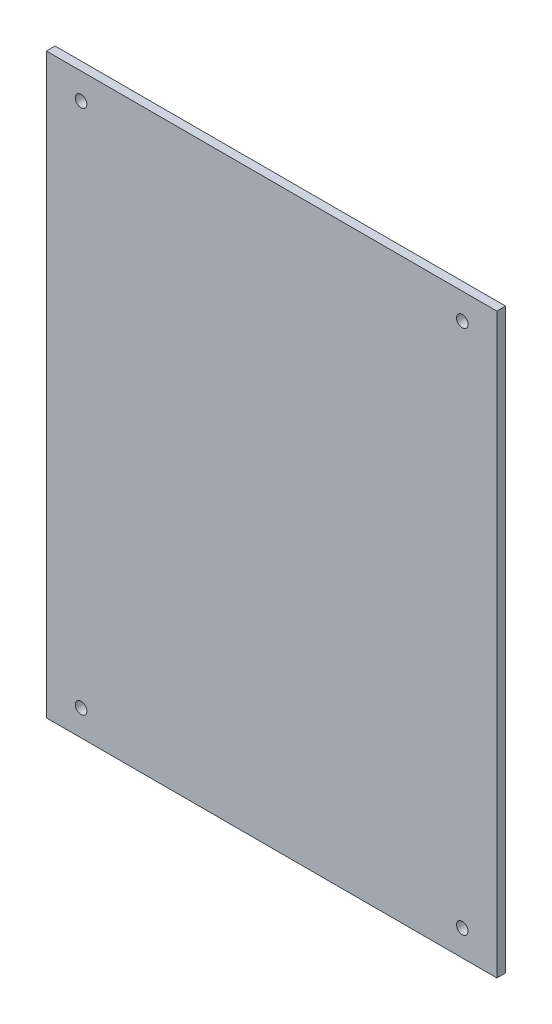
ISO-10303-21;
HEADER;
FILE_DESCRIPTION(('STEP AP214'),'2;1');
FILE_NAME('part.step','',(''),(''),'','','');
FILE_SCHEMA(('AUTOMOTIVE_DESIGN { 1 0 10303 214 1 1 1 1 }'));
ENDSEC;
DATA;
#1=APPLICATION_CONTEXT('core data for automotive mechanical design processes');
#2=APPLICATION_PROTOCOL_DEFINITION('international standard','automotive_design',2000,#1);
#3=PRODUCT_CONTEXT('',#1,'mechanical');
#4=PRODUCT('Part','Part','',(#3));
#5=PRODUCT_RELATED_PRODUCT_CATEGORY('part','',(#4));
#6=PRODUCT_DEFINITION_FORMATION('','',#4);
#7=PRODUCT_DEFINITION_CONTEXT('part definition',#1,'design');
#8=PRODUCT_DEFINITION('design','',#6,#7);
#9=PRODUCT_DEFINITION_SHAPE('','',#8);
#10=(LENGTH_UNIT() NAMED_UNIT(*) SI_UNIT(.MILLI.,.METRE.));
#11=(NAMED_UNIT(*) PLANE_ANGLE_UNIT() SI_UNIT($,.RADIAN.));
#12=(NAMED_UNIT(*) SI_UNIT($,.STERADIAN.) SOLID_ANGLE_UNIT());
#13=UNCERTAINTY_MEASURE_WITH_UNIT(LENGTH_MEASURE(1.E-05),#10,'distance_accuracy_value','');
#14=(GEOMETRIC_REPRESENTATION_CONTEXT(3) GLOBAL_UNCERTAINTY_ASSIGNED_CONTEXT((#13)) GLOBAL_UNIT_ASSIGNED_CONTEXT((#10,
#11,#12)) REPRESENTATION_CONTEXT('',''));
#15=CARTESIAN_POINT('',(0.,0.,0.));
#16=DIRECTION('',(0.,0.,1.));
#17=DIRECTION('',(1.,0.,0.));
#18=AXIS2_PLACEMENT_3D('',#15,#16,#17);
#19=CARTESIAN_POINT('',(0.,0.,3.));
#20=DIRECTION('',(1.,0.,0.));
#21=DIRECTION('',(0.,0.,-1.));
#22=AXIS2_PLACEMENT_3D('',#19,#20,#21);
#23=PLANE('',#22);
#24=DIRECTION('',(0.,-1.,0.));
#25=VECTOR('',#24,1.);
#26=CARTESIAN_POINT('',(0.,0.,0.));
#27=LINE('',#26,#25);
#28=CARTESIAN_POINT('',(0.,200.,0.));
#29=VERTEX_POINT('',#28);
#30=CARTESIAN_POINT('',(0.,0.,0.));
#31=VERTEX_POINT('',#30);
#32=EDGE_CURVE('E96',#29,#31,#27,.T.);
#33=ORIENTED_EDGE('',*,*,#32,.T.);
#34=DIRECTION('',(0.,0.,-1.));
#35=VECTOR('',#34,1.);
#36=CARTESIAN_POINT('',(0.,0.,3.));
#37=LINE('',#36,#35);
#38=CARTESIAN_POINT('',(0.,0.,3.));
#39=VERTEX_POINT('',#38);
#40=EDGE_CURVE('E11',#39,#31,#37,.T.);
#41=ORIENTED_EDGE('',*,*,#40,.F.);
#42=DIRECTION('',(0.,-1.,0.));
#43=VECTOR('',#42,1.);
#44=CARTESIAN_POINT('',(0.,0.,3.));
#45=LINE('',#44,#43);
#46=CARTESIAN_POINT('',(0.,200.,3.));
#47=VERTEX_POINT('',#46);
#48=EDGE_CURVE('E84',#47,#39,#45,.T.);
#49=ORIENTED_EDGE('',*,*,#48,.F.);
#50=DIRECTION('',(0.,0.,-1.));
#51=VECTOR('',#50,1.);
#52=CARTESIAN_POINT('',(0.,200.,3.));
#53=LINE('',#52,#51);
#54=EDGE_CURVE('E92',#47,#29,#53,.T.);
#55=ORIENTED_EDGE('',*,*,#54,.T.);
#56=EDGE_LOOP('',(#33,#41,#49,#55));
#57=FACE_BOUND('',#56,.T.);
#58=ADVANCED_FACE('F33',(#57),#23,.F.);
#59=CARTESIAN_POINT('',(0.,0.,3.));
#60=DIRECTION('',(0.,1.,0.));
#61=DIRECTION('',(0.,0.,1.));
#62=AXIS2_PLACEMENT_3D('',#59,#60,#61);
#63=PLANE('',#62);
#64=DIRECTION('',(1.,0.,0.));
#65=VECTOR('',#64,1.);
#66=CARTESIAN_POINT('',(0.,0.,0.));
#67=LINE('',#66,#65);
#68=CARTESIAN_POINT('',(156.,0.,0.));
#69=VERTEX_POINT('',#68);
#70=EDGE_CURVE('E88',#31,#69,#67,.T.);
#71=ORIENTED_EDGE('',*,*,#70,.T.);
#72=DIRECTION('',(0.,0.,-1.));
#73=VECTOR('',#72,1.);
#74=CARTESIAN_POINT('',(156.,0.,3.));
#75=LINE('',#74,#73);
#76=CARTESIAN_POINT('',(156.,0.,3.));
#77=VERTEX_POINT('',#76);
#78=EDGE_CURVE('E41',#77,#69,#75,.T.);
#79=ORIENTED_EDGE('',*,*,#78,.F.);
#80=DIRECTION('',(1.,0.,0.));
#81=VECTOR('',#80,1.);
#82=CARTESIAN_POINT('',(0.,0.,3.));
#83=LINE('',#82,#81);
#84=EDGE_CURVE('E79',#39,#77,#83,.T.);
#85=ORIENTED_EDGE('',*,*,#84,.F.);
#86=ORIENTED_EDGE('',*,*,#40,.T.);
#87=EDGE_LOOP('',(#71,#79,#85,#86));
#88=FACE_BOUND('',#87,.T.);
#89=ADVANCED_FACE('F87',(#88),#63,.F.);
#90=CARTESIAN_POINT('',(156.,0.,3.));
#91=DIRECTION('',(-1.,0.,0.));
#92=DIRECTION('',(0.,0.,1.));
#93=AXIS2_PLACEMENT_3D('',#90,#91,#92);
#94=PLANE('',#93);
#95=DIRECTION('',(0.,1.,0.));
#96=VECTOR('',#95,1.);
#97=CARTESIAN_POINT('',(156.,0.,0.));
#98=LINE('',#97,#96);
#99=CARTESIAN_POINT('',(156.,200.,0.));
#100=VERTEX_POINT('',#99);
#101=EDGE_CURVE('E66',#69,#100,#98,.T.);
#102=ORIENTED_EDGE('',*,*,#101,.T.);
#103=DIRECTION('',(0.,0.,-1.));
#104=VECTOR('',#103,1.);
#105=CARTESIAN_POINT('',(156.,200.,3.));
#106=LINE('',#105,#104);
#107=CARTESIAN_POINT('',(156.,200.,3.));
#108=VERTEX_POINT('',#107);
#109=EDGE_CURVE('E89',#108,#100,#106,.T.);
#110=ORIENTED_EDGE('',*,*,#109,.F.);
#111=DIRECTION('',(0.,1.,0.));
#112=VECTOR('',#111,1.);
#113=CARTESIAN_POINT('',(156.,0.,3.));
#114=LINE('',#113,#112);
#115=EDGE_CURVE('E82',#77,#108,#114,.T.);
#116=ORIENTED_EDGE('',*,*,#115,.F.);
#117=ORIENTED_EDGE('',*,*,#78,.T.);
#118=EDGE_LOOP('',(#102,#110,#116,#117));
#119=FACE_BOUND('',#118,.T.);
#120=ADVANCED_FACE('F90',(#119),#94,.F.);
#121=CARTESIAN_POINT('',(0.,200.,3.));
#122=DIRECTION('',(0.,-1.,0.));
#123=DIRECTION('',(0.,0.,-1.));
#124=AXIS2_PLACEMENT_3D('',#121,#122,#123);
#125=PLANE('',#124);
#126=DIRECTION('',(-1.,0.,0.));
#127=VECTOR('',#126,1.);
#128=CARTESIAN_POINT('',(0.,200.,0.));
#129=LINE('',#128,#127);
#130=EDGE_CURVE('E72',#100,#29,#129,.T.);
#131=ORIENTED_EDGE('',*,*,#130,.T.);
#132=ORIENTED_EDGE('',*,*,#54,.F.);
#133=DIRECTION('',(-1.,0.,0.));
#134=VECTOR('',#133,1.);
#135=CARTESIAN_POINT('',(0.,200.,3.));
#136=LINE('',#135,#134);
#137=EDGE_CURVE('E49',#108,#47,#136,.T.);
#138=ORIENTED_EDGE('',*,*,#137,.F.);
#139=ORIENTED_EDGE('',*,*,#109,.T.);
#140=EDGE_LOOP('',(#131,#132,#138,#139));
#141=FACE_BOUND('',#140,.T.);
#142=ADVANCED_FACE('F104',(#141),#125,.F.);
#143=CARTESIAN_POINT('',(0.,0.,3.));
#144=DIRECTION('',(0.,0.,-1.));
#145=DIRECTION('',(-1.,0.,0.));
#146=AXIS2_PLACEMENT_3D('',#143,#144,#145);
#147=PLANE('',#146);
#148=CARTESIAN_POINT('',(144.,9.00000000000002,3.));
#149=DIRECTION('',(0.,0.,1.));
#150=DIRECTION('',(-1.,0.,0.));
#151=AXIS2_PLACEMENT_3D('',#148,#149,#150);
#152=CIRCLE('',#151,2.);
#153=CARTESIAN_POINT('',(142.,9.00000000000002,3.));
#154=VERTEX_POINT('',#153);
#155=EDGE_CURVE('E128',#154,#154,#152,.T.);
#156=ORIENTED_EDGE('',*,*,#155,.F.);
#157=EDGE_LOOP('',(#156));
#158=FACE_BOUND('',#157,.T.);
#159=CARTESIAN_POINT('',(144.,191.,3.));
#160=DIRECTION('',(0.,0.,1.));
#161=DIRECTION('',(1.,0.,0.));
#162=AXIS2_PLACEMENT_3D('',#159,#160,#161);
#163=CIRCLE('',#162,2.);
#164=CARTESIAN_POINT('',(146.,191.,3.));
#165=VERTEX_POINT('',#164);
#166=EDGE_CURVE('E122',#165,#165,#163,.T.);
#167=ORIENTED_EDGE('',*,*,#166,.F.);
#168=EDGE_LOOP('',(#167));
#169=FACE_BOUND('',#168,.T.);
#170=CARTESIAN_POINT('',(12.,191.,3.));
#171=DIRECTION('',(0.,0.,1.));
#172=DIRECTION('',(-1.,0.,0.));
#173=AXIS2_PLACEMENT_3D('',#170,#171,#172);
#174=CIRCLE('',#173,2.);
#175=CARTESIAN_POINT('',(9.99999999999998,191.,3.));
#176=VERTEX_POINT('',#175);
#177=EDGE_CURVE('E116',#176,#176,#174,.T.);
#178=ORIENTED_EDGE('',*,*,#177,.F.);
#179=EDGE_LOOP('',(#178));
#180=FACE_BOUND('',#179,.T.);
#181=CARTESIAN_POINT('',(12.,9.00000000000001,3.));
#182=DIRECTION('',(0.,0.,1.));
#183=DIRECTION('',(1.,0.,0.));
#184=AXIS2_PLACEMENT_3D('',#181,#182,#183);
#185=CIRCLE('',#184,2.);
#186=CARTESIAN_POINT('',(14.,9.00000000000001,3.));
#187=VERTEX_POINT('',#186);
#188=EDGE_CURVE('E110',#187,#187,#185,.T.);
#189=ORIENTED_EDGE('',*,*,#188,.F.);
#190=EDGE_LOOP('',(#189));
#191=FACE_BOUND('',#190,.T.);
#192=ORIENTED_EDGE('',*,*,#48,.T.);
#193=ORIENTED_EDGE('',*,*,#84,.T.);
#194=ORIENTED_EDGE('',*,*,#115,.T.);
#195=ORIENTED_EDGE('',*,*,#137,.T.);
#196=EDGE_LOOP('',(#192,#193,#194,#195));
#197=FACE_BOUND('',#196,.T.);
#198=ADVANCED_FACE('F80',(#158,#169,#180,#191,#197),#147,.F.);
#199=CARTESIAN_POINT('',(0.,0.,0.));
#200=DIRECTION('',(0.,0.,-1.));
#201=DIRECTION('',(-1.,0.,0.));
#202=AXIS2_PLACEMENT_3D('',#199,#200,#201);
#203=PLANE('',#202);
#204=CARTESIAN_POINT('',(144.,9.00000000000002,0.));
#205=DIRECTION('',(0.,0.,1.));
#206=DIRECTION('',(-1.,0.,0.));
#207=AXIS2_PLACEMENT_3D('',#204,#205,#206);
#208=CIRCLE('',#207,2.);
#209=CARTESIAN_POINT('',(142.,9.00000000000002,0.));
#210=VERTEX_POINT('',#209);
#211=EDGE_CURVE('E113',#210,#210,#208,.T.);
#212=ORIENTED_EDGE('',*,*,#211,.T.);
#213=EDGE_LOOP('',(#212));
#214=FACE_BOUND('',#213,.T.);
#215=CARTESIAN_POINT('',(144.,191.,0.));
#216=DIRECTION('',(0.,0.,1.));
#217=DIRECTION('',(1.,0.,0.));
#218=AXIS2_PLACEMENT_3D('',#215,#216,#217);
#219=CIRCLE('',#218,2.);
#220=CARTESIAN_POINT('',(146.,191.,0.));
#221=VERTEX_POINT('',#220);
#222=EDGE_CURVE('E125',#221,#221,#219,.T.);
#223=ORIENTED_EDGE('',*,*,#222,.T.);
#224=EDGE_LOOP('',(#223));
#225=FACE_BOUND('',#224,.T.);
#226=CARTESIAN_POINT('',(12.,191.,0.));
#227=DIRECTION('',(0.,0.,1.));
#228=DIRECTION('',(-1.,0.,0.));
#229=AXIS2_PLACEMENT_3D('',#226,#227,#228);
#230=CIRCLE('',#229,2.);
#231=CARTESIAN_POINT('',(9.99999999999998,191.,0.));
#232=VERTEX_POINT('',#231);
#233=EDGE_CURVE('E119',#232,#232,#230,.T.);
#234=ORIENTED_EDGE('',*,*,#233,.T.);
#235=EDGE_LOOP('',(#234));
#236=FACE_BOUND('',#235,.T.);
#237=CARTESIAN_POINT('',(12.,9.00000000000001,0.));
#238=DIRECTION('',(0.,0.,1.));
#239=DIRECTION('',(1.,0.,0.));
#240=AXIS2_PLACEMENT_3D('',#237,#238,#239);
#241=CIRCLE('',#240,2.);
#242=CARTESIAN_POINT('',(14.,9.00000000000001,0.));
#243=VERTEX_POINT('',#242);
#244=EDGE_CURVE('E99',#243,#243,#241,.T.);
#245=ORIENTED_EDGE('',*,*,#244,.T.);
#246=EDGE_LOOP('',(#245));
#247=FACE_BOUND('',#246,.T.);
#248=ORIENTED_EDGE('',*,*,#32,.F.);
#249=ORIENTED_EDGE('',*,*,#130,.F.);
#250=ORIENTED_EDGE('',*,*,#101,.F.);
#251=ORIENTED_EDGE('',*,*,#70,.F.);
#252=EDGE_LOOP('',(#248,#249,#250,#251));
#253=FACE_BOUND('',#252,.T.);
#254=ADVANCED_FACE('F107',(#214,#225,#236,#247,#253),#203,.T.);
#255=CARTESIAN_POINT('',(12.,9.00000000000001,0.));
#256=DIRECTION('',(0.,0.,1.));
#257=DIRECTION('',(1.,0.,0.));
#258=AXIS2_PLACEMENT_3D('',#255,#256,#257);
#259=CYLINDRICAL_SURFACE('',#258,2.);
#260=ORIENTED_EDGE('',*,*,#244,.F.);
#261=EDGE_LOOP('',(#260));
#262=FACE_BOUND('',#261,.T.);
#263=ORIENTED_EDGE('',*,*,#188,.T.);
#264=EDGE_LOOP('',(#263));
#265=FACE_BOUND('',#264,.T.);
#266=ADVANCED_FACE('F152',(#262,#265),#259,.F.);
#267=CARTESIAN_POINT('',(12.,191.,0.));
#268=DIRECTION('',(0.,0.,1.));
#269=DIRECTION('',(1.,0.,0.));
#270=AXIS2_PLACEMENT_3D('',#267,#268,#269);
#271=CYLINDRICAL_SURFACE('',#270,2.);
#272=ORIENTED_EDGE('',*,*,#233,.F.);
#273=EDGE_LOOP('',(#272));
#274=FACE_BOUND('',#273,.T.);
#275=ORIENTED_EDGE('',*,*,#177,.T.);
#276=EDGE_LOOP('',(#275));
#277=FACE_BOUND('',#276,.T.);
#278=ADVANCED_FACE('F154',(#274,#277),#271,.F.);
#279=CARTESIAN_POINT('',(144.,191.,0.));
#280=DIRECTION('',(0.,0.,1.));
#281=DIRECTION('',(1.,0.,0.));
#282=AXIS2_PLACEMENT_3D('',#279,#280,#281);
#283=CYLINDRICAL_SURFACE('',#282,2.);
#284=ORIENTED_EDGE('',*,*,#222,.F.);
#285=EDGE_LOOP('',(#284));
#286=FACE_BOUND('',#285,.T.);
#287=ORIENTED_EDGE('',*,*,#166,.T.);
#288=EDGE_LOOP('',(#287));
#289=FACE_BOUND('',#288,.T.);
#290=ADVANCED_FACE('F139',(#286,#289),#283,.F.);
#291=CARTESIAN_POINT('',(144.,9.00000000000002,0.));
#292=DIRECTION('',(0.,0.,1.));
#293=DIRECTION('',(1.,0.,0.));
#294=AXIS2_PLACEMENT_3D('',#291,#292,#293);
#295=CYLINDRICAL_SURFACE('',#294,2.);
#296=ORIENTED_EDGE('',*,*,#211,.F.);
#297=EDGE_LOOP('',(#296));
#298=FACE_BOUND('',#297,.T.);
#299=ORIENTED_EDGE('',*,*,#155,.T.);
#300=EDGE_LOOP('',(#299));
#301=FACE_BOUND('',#300,.T.);
#302=ADVANCED_FACE('F136',(#298,#301),#295,.F.);
#303=CLOSED_SHELL('',(#58,#89,#120,#142,#198,#254,#266,#278,#290,#302));
#304=MANIFOLD_SOLID_BREP('B2',#303);
#305=ADVANCED_BREP_SHAPE_REPRESENTATION('',(#18,#304),#14);
#306=SHAPE_DEFINITION_REPRESENTATION(#9,#305);
ENDSEC;
END-ISO-10303-21;
